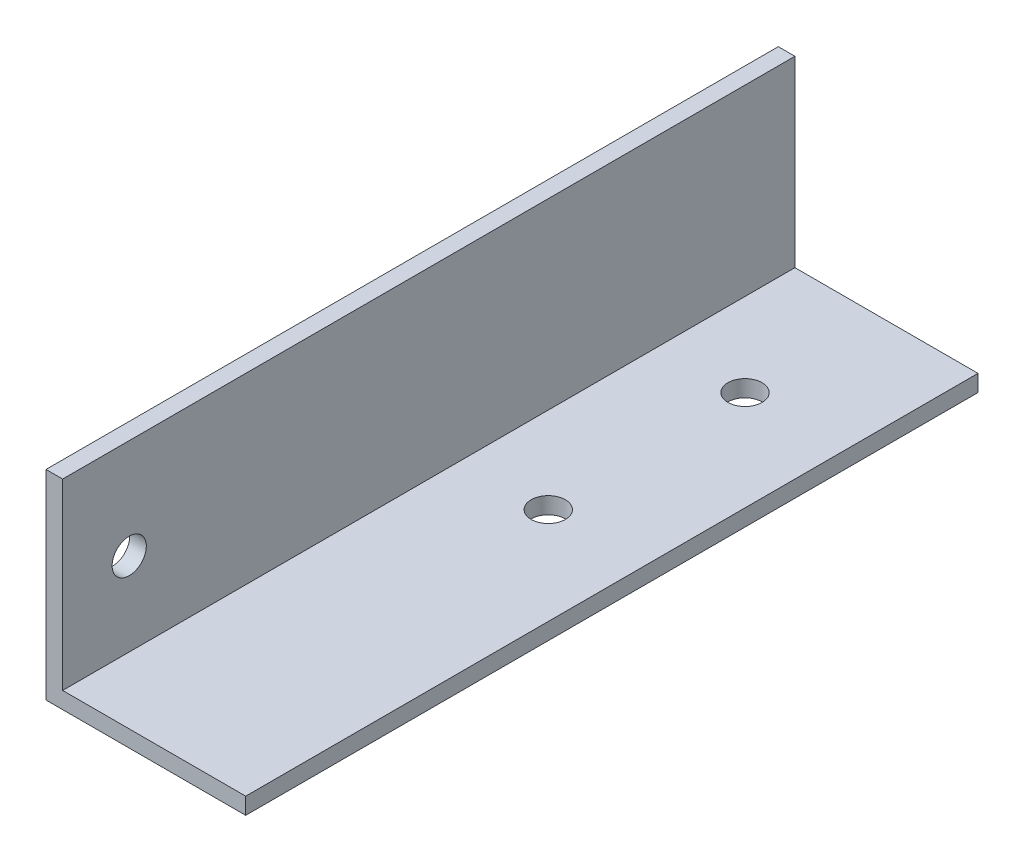
ISO-10303-21;
HEADER;
FILE_DESCRIPTION(('STEP AP214'),'2;1');
FILE_NAME('part.step','',(''),(''),'','','');
FILE_SCHEMA(('AUTOMOTIVE_DESIGN { 1 0 10303 214 1 1 1 1 }'));
ENDSEC;
DATA;
#1=APPLICATION_CONTEXT('core data for automotive mechanical design processes');
#2=APPLICATION_PROTOCOL_DEFINITION('international standard','automotive_design',2000,#1);
#3=PRODUCT_CONTEXT('',#1,'mechanical');
#4=PRODUCT('Part','Part','',(#3));
#5=PRODUCT_RELATED_PRODUCT_CATEGORY('part','',(#4));
#6=PRODUCT_DEFINITION_FORMATION('','',#4);
#7=PRODUCT_DEFINITION_CONTEXT('part definition',#1,'design');
#8=PRODUCT_DEFINITION('design','',#6,#7);
#9=PRODUCT_DEFINITION_SHAPE('','',#8);
#10=(LENGTH_UNIT() NAMED_UNIT(*) SI_UNIT(.MILLI.,.METRE.));
#11=(NAMED_UNIT(*) PLANE_ANGLE_UNIT() SI_UNIT($,.RADIAN.));
#12=(NAMED_UNIT(*) SI_UNIT($,.STERADIAN.) SOLID_ANGLE_UNIT());
#13=UNCERTAINTY_MEASURE_WITH_UNIT(LENGTH_MEASURE(1.E-05),#10,'distance_accuracy_value','');
#14=(GEOMETRIC_REPRESENTATION_CONTEXT(3) GLOBAL_UNCERTAINTY_ASSIGNED_CONTEXT((#13)) GLOBAL_UNIT_ASSIGNED_CONTEXT((#10,
#11,#12)) REPRESENTATION_CONTEXT('',''));
#15=CARTESIAN_POINT('',(0.,0.,0.));
#16=DIRECTION('',(0.,0.,1.));
#17=DIRECTION('',(1.,0.,0.));
#18=AXIS2_PLACEMENT_3D('',#15,#16,#17);
#19=CARTESIAN_POINT('',(19.05,0.,69.85));
#20=DIRECTION('',(0.,1.,0.));
#21=DIRECTION('',(-1.,0.,0.));
#22=AXIS2_PLACEMENT_3D('',#19,#20,#21);
#23=PLANE('',#22);
#24=CARTESIAN_POINT('',(9.525,0.,12.7));
#25=DIRECTION('',(0.,1.,0.));
#26=DIRECTION('',(0.,0.,1.));
#27=AXIS2_PLACEMENT_3D('',#24,#25,#26);
#28=CIRCLE('',#27,1.63195);
#29=CARTESIAN_POINT('',(9.525,0.,14.33195));
#30=VERTEX_POINT('',#29);
#31=EDGE_CURVE('E163',#30,#30,#28,.T.);
#32=ORIENTED_EDGE('',*,*,#31,.T.);
#33=EDGE_LOOP('',(#32));
#34=FACE_BOUND('',#33,.T.);
#35=CARTESIAN_POINT('',(9.80791565084615,0.,31.75));
#36=DIRECTION('',(0.,1.,0.));
#37=DIRECTION('',(0.,0.,1.));
#38=AXIS2_PLACEMENT_3D('',#35,#36,#37);
#39=CIRCLE('',#38,1.63195);
#40=CARTESIAN_POINT('',(9.80791565084615,0.,33.38195));
#41=VERTEX_POINT('',#40);
#42=EDGE_CURVE('E166',#41,#41,#39,.T.);
#43=ORIENTED_EDGE('',*,*,#42,.T.);
#44=EDGE_LOOP('',(#43));
#45=FACE_BOUND('',#44,.T.);
#46=DIRECTION('',(1.,0.,0.));
#47=VECTOR('',#46,1.);
#48=CARTESIAN_POINT('',(19.05,0.,0.));
#49=LINE('',#48,#47);
#50=CARTESIAN_POINT('',(0.,0.,0.));
#51=VERTEX_POINT('',#50);
#52=CARTESIAN_POINT('',(19.05,0.,0.));
#53=VERTEX_POINT('',#52);
#54=EDGE_CURVE('E118',#51,#53,#49,.T.);
#55=ORIENTED_EDGE('',*,*,#54,.T.);
#56=DIRECTION('',(0.,0.,-1.));
#57=VECTOR('',#56,1.);
#58=CARTESIAN_POINT('',(19.05,0.,69.85));
#59=LINE('',#58,#57);
#60=CARTESIAN_POINT('',(19.05,0.,69.85));
#61=VERTEX_POINT('',#60);
#62=EDGE_CURVE('E11',#61,#53,#59,.T.);
#63=ORIENTED_EDGE('',*,*,#62,.F.);
#64=DIRECTION('',(1.,0.,0.));
#65=VECTOR('',#64,1.);
#66=CARTESIAN_POINT('',(19.05,0.,69.85));
#67=LINE('',#66,#65);
#68=CARTESIAN_POINT('',(0.,0.,69.85));
#69=VERTEX_POINT('',#68);
#70=EDGE_CURVE('E129',#69,#61,#67,.T.);
#71=ORIENTED_EDGE('',*,*,#70,.F.);
#72=DIRECTION('',(0.,0.,-1.));
#73=VECTOR('',#72,1.);
#74=CARTESIAN_POINT('',(0.,0.,69.85));
#75=LINE('',#74,#73);
#76=EDGE_CURVE('E114',#69,#51,#75,.T.);
#77=ORIENTED_EDGE('',*,*,#76,.T.);
#78=EDGE_LOOP('',(#55,#63,#71,#77));
#79=FACE_BOUND('',#78,.T.);
#80=ADVANCED_FACE('F34',(#34,#45,#79),#23,.F.);
#81=CARTESIAN_POINT('',(19.05,1.5875,69.85));
#82=DIRECTION('',(-1.,0.,0.));
#83=DIRECTION('',(0.,0.,1.));
#84=AXIS2_PLACEMENT_3D('',#81,#82,#83);
#85=PLANE('',#84);
#86=DIRECTION('',(0.,1.,0.));
#87=VECTOR('',#86,1.);
#88=CARTESIAN_POINT('',(19.05,1.5875,0.));
#89=LINE('',#88,#87);
#90=CARTESIAN_POINT('',(19.05,1.5875,0.));
#91=VERTEX_POINT('',#90);
#92=EDGE_CURVE('E121',#53,#91,#89,.T.);
#93=ORIENTED_EDGE('',*,*,#92,.T.);
#94=DIRECTION('',(0.,0.,-1.));
#95=VECTOR('',#94,1.);
#96=CARTESIAN_POINT('',(19.05,1.5875,69.85));
#97=LINE('',#96,#95);
#98=CARTESIAN_POINT('',(19.05,1.5875,69.85));
#99=VERTEX_POINT('',#98);
#100=EDGE_CURVE('E42',#99,#91,#97,.T.);
#101=ORIENTED_EDGE('',*,*,#100,.F.);
#102=DIRECTION('',(0.,1.,0.));
#103=VECTOR('',#102,1.);
#104=CARTESIAN_POINT('',(19.05,1.5875,69.85));
#105=LINE('',#104,#103);
#106=EDGE_CURVE('E87',#61,#99,#105,.T.);
#107=ORIENTED_EDGE('',*,*,#106,.F.);
#108=ORIENTED_EDGE('',*,*,#62,.T.);
#109=EDGE_LOOP('',(#93,#101,#107,#108));
#110=FACE_BOUND('',#109,.T.);
#111=ADVANCED_FACE('F155',(#110),#85,.F.);
#112=CARTESIAN_POINT('',(1.5875,1.5875,69.85));
#113=DIRECTION('',(0.,-1.,0.));
#114=DIRECTION('',(0.,0.,-1.));
#115=AXIS2_PLACEMENT_3D('',#112,#113,#114);
#116=PLANE('',#115);
#117=CARTESIAN_POINT('',(9.525,1.5875,12.7));
#118=DIRECTION('',(0.,1.,0.));
#119=DIRECTION('',(0.,0.,1.));
#120=AXIS2_PLACEMENT_3D('',#117,#118,#119);
#121=CIRCLE('',#120,1.63194999999999);
#122=CARTESIAN_POINT('',(9.525,1.5875,14.33195));
#123=VERTEX_POINT('',#122);
#124=EDGE_CURVE('E200',#123,#123,#121,.T.);
#125=ORIENTED_EDGE('',*,*,#124,.F.);
#126=EDGE_LOOP('',(#125));
#127=FACE_BOUND('',#126,.T.);
#128=CARTESIAN_POINT('',(9.80791565084615,1.5875,31.75));
#129=DIRECTION('',(0.,1.,0.));
#130=DIRECTION('',(0.,0.,1.));
#131=AXIS2_PLACEMENT_3D('',#128,#129,#130);
#132=CIRCLE('',#131,1.63194999999999);
#133=CARTESIAN_POINT('',(9.80791565084615,1.5875,33.38195));
#134=VERTEX_POINT('',#133);
#135=EDGE_CURVE('E169',#134,#134,#132,.T.);
#136=ORIENTED_EDGE('',*,*,#135,.F.);
#137=EDGE_LOOP('',(#136));
#138=FACE_BOUND('',#137,.T.);
#139=DIRECTION('',(-1.,0.,0.));
#140=VECTOR('',#139,1.);
#141=CARTESIAN_POINT('',(1.5875,1.5875,0.));
#142=LINE('',#141,#140);
#143=CARTESIAN_POINT('',(1.5875,1.5875,0.));
#144=VERTEX_POINT('',#143);
#145=EDGE_CURVE('E124',#91,#144,#142,.T.);
#146=ORIENTED_EDGE('',*,*,#145,.T.);
#147=DIRECTION('',(0.,0.,-1.));
#148=VECTOR('',#147,1.);
#149=CARTESIAN_POINT('',(1.5875,1.5875,69.85));
#150=LINE('',#149,#148);
#151=CARTESIAN_POINT('',(1.5875,1.5875,69.85));
#152=VERTEX_POINT('',#151);
#153=EDGE_CURVE('E109',#152,#144,#150,.T.);
#154=ORIENTED_EDGE('',*,*,#153,.F.);
#155=DIRECTION('',(-1.,0.,0.));
#156=VECTOR('',#155,1.);
#157=CARTESIAN_POINT('',(1.5875,1.5875,69.85));
#158=LINE('',#157,#156);
#159=EDGE_CURVE('E100',#99,#152,#158,.T.);
#160=ORIENTED_EDGE('',*,*,#159,.F.);
#161=ORIENTED_EDGE('',*,*,#100,.T.);
#162=EDGE_LOOP('',(#146,#154,#160,#161));
#163=FACE_BOUND('',#162,.T.);
#164=ADVANCED_FACE('F135',(#127,#138,#163),#116,.F.);
#165=CARTESIAN_POINT('',(1.5875,19.05,69.85));
#166=DIRECTION('',(-1.,0.,0.));
#167=DIRECTION('',(0.,-1.,0.));
#168=AXIS2_PLACEMENT_3D('',#165,#166,#167);
#169=PLANE('',#168);
#170=CARTESIAN_POINT('',(1.5875,9.525,63.5));
#171=DIRECTION('',(1.,0.,0.));
#172=DIRECTION('',(0.,0.,-1.));
#173=AXIS2_PLACEMENT_3D('',#170,#171,#172);
#174=CIRCLE('',#173,1.63194999999999);
#175=CARTESIAN_POINT('',(1.5875,9.525,61.86805));
#176=VERTEX_POINT('',#175);
#177=EDGE_CURVE('E168',#176,#176,#174,.T.);
#178=ORIENTED_EDGE('',*,*,#177,.F.);
#179=EDGE_LOOP('',(#178));
#180=FACE_BOUND('',#179,.T.);
#181=DIRECTION('',(0.,1.,0.));
#182=VECTOR('',#181,1.);
#183=CARTESIAN_POINT('',(1.5875,19.05,0.));
#184=LINE('',#183,#182);
#185=CARTESIAN_POINT('',(1.5875,19.05,0.));
#186=VERTEX_POINT('',#185);
#187=EDGE_CURVE('E108',#144,#186,#184,.T.);
#188=ORIENTED_EDGE('',*,*,#187,.T.);
#189=DIRECTION('',(0.,0.,-1.));
#190=VECTOR('',#189,1.);
#191=CARTESIAN_POINT('',(1.5875,19.05,69.85));
#192=LINE('',#191,#190);
#193=CARTESIAN_POINT('',(1.5875,19.05,69.85));
#194=VERTEX_POINT('',#193);
#195=EDGE_CURVE('E105',#194,#186,#192,.T.);
#196=ORIENTED_EDGE('',*,*,#195,.F.);
#197=DIRECTION('',(0.,1.,0.));
#198=VECTOR('',#197,1.);
#199=CARTESIAN_POINT('',(1.5875,19.05,69.85));
#200=LINE('',#199,#198);
#201=EDGE_CURVE('E94',#152,#194,#200,.T.);
#202=ORIENTED_EDGE('',*,*,#201,.F.);
#203=ORIENTED_EDGE('',*,*,#153,.T.);
#204=EDGE_LOOP('',(#188,#196,#202,#203));
#205=FACE_BOUND('',#204,.T.);
#206=ADVANCED_FACE('F106',(#180,#205),#169,.F.);
#207=CARTESIAN_POINT('',(0.,19.05,69.85));
#208=DIRECTION('',(0.,-1.,0.));
#209=DIRECTION('',(0.,0.,-1.));
#210=AXIS2_PLACEMENT_3D('',#207,#208,#209);
#211=PLANE('',#210);
#212=DIRECTION('',(-1.,0.,0.));
#213=VECTOR('',#212,1.);
#214=CARTESIAN_POINT('',(0.,19.05,0.));
#215=LINE('',#214,#213);
#216=CARTESIAN_POINT('',(0.,19.05,0.));
#217=VERTEX_POINT('',#216);
#218=EDGE_CURVE('E73',#186,#217,#215,.T.);
#219=ORIENTED_EDGE('',*,*,#218,.T.);
#220=DIRECTION('',(0.,0.,-1.));
#221=VECTOR('',#220,1.);
#222=CARTESIAN_POINT('',(0.,19.05,69.85));
#223=LINE('',#222,#221);
#224=CARTESIAN_POINT('',(0.,19.05,69.85));
#225=VERTEX_POINT('',#224);
#226=EDGE_CURVE('E110',#225,#217,#223,.T.);
#227=ORIENTED_EDGE('',*,*,#226,.F.);
#228=DIRECTION('',(-1.,0.,0.));
#229=VECTOR('',#228,1.);
#230=CARTESIAN_POINT('',(0.,19.05,69.85));
#231=LINE('',#230,#229);
#232=EDGE_CURVE('E98',#194,#225,#231,.T.);
#233=ORIENTED_EDGE('',*,*,#232,.F.);
#234=ORIENTED_EDGE('',*,*,#195,.T.);
#235=EDGE_LOOP('',(#219,#227,#233,#234));
#236=FACE_BOUND('',#235,.T.);
#237=ADVANCED_FACE('F112',(#236),#211,.F.);
#238=CARTESIAN_POINT('',(0.,0.,69.85));
#239=DIRECTION('',(1.,0.,0.));
#240=DIRECTION('',(0.,0.,-1.));
#241=AXIS2_PLACEMENT_3D('',#238,#239,#240);
#242=PLANE('',#241);
#243=CARTESIAN_POINT('',(0.,9.525,63.5));
#244=DIRECTION('',(1.,0.,0.));
#245=DIRECTION('',(0.,0.,-1.));
#246=AXIS2_PLACEMENT_3D('',#243,#244,#245);
#247=CIRCLE('',#246,1.63195);
#248=CARTESIAN_POINT('',(0.,9.525,61.86805));
#249=VERTEX_POINT('',#248);
#250=EDGE_CURVE('E122',#249,#249,#247,.T.);
#251=ORIENTED_EDGE('',*,*,#250,.T.);
#252=EDGE_LOOP('',(#251));
#253=FACE_BOUND('',#252,.T.);
#254=DIRECTION('',(0.,-1.,0.));
#255=VECTOR('',#254,1.);
#256=CARTESIAN_POINT('',(0.,0.,0.));
#257=LINE('',#256,#255);
#258=EDGE_CURVE('E79',#217,#51,#257,.T.);
#259=ORIENTED_EDGE('',*,*,#258,.T.);
#260=ORIENTED_EDGE('',*,*,#76,.F.);
#261=DIRECTION('',(0.,-1.,0.));
#262=VECTOR('',#261,1.);
#263=CARTESIAN_POINT('',(0.,0.,69.85));
#264=LINE('',#263,#262);
#265=EDGE_CURVE('E50',#225,#69,#264,.T.);
#266=ORIENTED_EDGE('',*,*,#265,.F.);
#267=ORIENTED_EDGE('',*,*,#226,.T.);
#268=EDGE_LOOP('',(#259,#260,#266,#267));
#269=FACE_BOUND('',#268,.T.);
#270=ADVANCED_FACE('F142',(#253,#269),#242,.F.);
#271=CARTESIAN_POINT('',(0.,0.,69.85));
#272=DIRECTION('',(0.,0.,-1.));
#273=DIRECTION('',(-1.,0.,0.));
#274=AXIS2_PLACEMENT_3D('',#271,#272,#273);
#275=PLANE('',#274);
#276=ORIENTED_EDGE('',*,*,#70,.T.);
#277=ORIENTED_EDGE('',*,*,#106,.T.);
#278=ORIENTED_EDGE('',*,*,#159,.T.);
#279=ORIENTED_EDGE('',*,*,#201,.T.);
#280=ORIENTED_EDGE('',*,*,#232,.T.);
#281=ORIENTED_EDGE('',*,*,#265,.T.);
#282=EDGE_LOOP('',(#276,#277,#278,#279,#280,#281));
#283=FACE_BOUND('',#282,.T.);
#284=ADVANCED_FACE('F96',(#283),#275,.F.);
#285=CARTESIAN_POINT('',(0.,0.,0.));
#286=DIRECTION('',(0.,0.,-1.));
#287=DIRECTION('',(-1.,0.,0.));
#288=AXIS2_PLACEMENT_3D('',#285,#286,#287);
#289=PLANE('',#288);
#290=ORIENTED_EDGE('',*,*,#54,.F.);
#291=ORIENTED_EDGE('',*,*,#258,.F.);
#292=ORIENTED_EDGE('',*,*,#218,.F.);
#293=ORIENTED_EDGE('',*,*,#187,.F.);
#294=ORIENTED_EDGE('',*,*,#145,.F.);
#295=ORIENTED_EDGE('',*,*,#92,.F.);
#296=EDGE_LOOP('',(#290,#291,#292,#293,#294,#295));
#297=FACE_BOUND('',#296,.T.);
#298=ADVANCED_FACE('F138',(#297),#289,.T.);
#299=CARTESIAN_POINT('',(1.5875,9.525,63.5));
#300=DIRECTION('',(1.,0.,0.));
#301=DIRECTION('',(0.,0.,-1.));
#302=AXIS2_PLACEMENT_3D('',#299,#300,#301);
#303=CYLINDRICAL_SURFACE('',#302,1.63194999999999);
#304=ORIENTED_EDGE('',*,*,#250,.F.);
#305=EDGE_LOOP('',(#304));
#306=FACE_BOUND('',#305,.T.);
#307=ORIENTED_EDGE('',*,*,#177,.T.);
#308=EDGE_LOOP('',(#307));
#309=FACE_BOUND('',#308,.T.);
#310=ADVANCED_FACE('F181',(#306,#309),#303,.F.);
#311=CARTESIAN_POINT('',(9.80791565084615,1.5875,31.75));
#312=DIRECTION('',(0.,1.,0.));
#313=DIRECTION('',(0.,0.,1.));
#314=AXIS2_PLACEMENT_3D('',#311,#312,#313);
#315=CYLINDRICAL_SURFACE('',#314,1.63194999999999);
#316=ORIENTED_EDGE('',*,*,#42,.F.);
#317=EDGE_LOOP('',(#316));
#318=FACE_BOUND('',#317,.T.);
#319=ORIENTED_EDGE('',*,*,#135,.T.);
#320=EDGE_LOOP('',(#319));
#321=FACE_BOUND('',#320,.T.);
#322=ADVANCED_FACE('F184',(#318,#321),#315,.F.);
#323=CARTESIAN_POINT('',(9.525,1.5875,12.7));
#324=DIRECTION('',(0.,1.,0.));
#325=DIRECTION('',(0.,0.,1.));
#326=AXIS2_PLACEMENT_3D('',#323,#324,#325);
#327=CYLINDRICAL_SURFACE('',#326,1.63194999999999);
#328=ORIENTED_EDGE('',*,*,#31,.F.);
#329=EDGE_LOOP('',(#328));
#330=FACE_BOUND('',#329,.T.);
#331=ORIENTED_EDGE('',*,*,#124,.T.);
#332=EDGE_LOOP('',(#331));
#333=FACE_BOUND('',#332,.T.);
#334=ADVANCED_FACE('F204',(#330,#333),#327,.F.);
#335=CLOSED_SHELL('',(#80,#111,#164,#206,#237,#270,#284,#298,#310,#322,#334));
#336=MANIFOLD_SOLID_BREP('B2',#335);
#337=ADVANCED_BREP_SHAPE_REPRESENTATION('',(#18,#336),#14);
#338=SHAPE_DEFINITION_REPRESENTATION(#9,#337);
ENDSEC;
END-ISO-10303-21;
